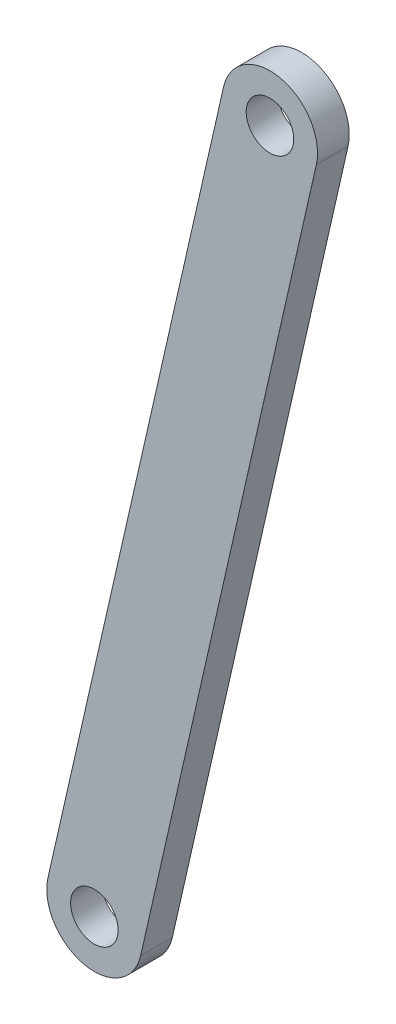
ISO-10303-21;
HEADER;
FILE_DESCRIPTION(('STEP AP214'),'2;1');
FILE_NAME('part.step','',(''),(''),'','','');
FILE_SCHEMA(('AUTOMOTIVE_DESIGN { 1 0 10303 214 1 1 1 1 }'));
ENDSEC;
DATA;
#1=APPLICATION_CONTEXT('core data for automotive mechanical design processes');
#2=APPLICATION_PROTOCOL_DEFINITION('international standard','automotive_design',2000,#1);
#3=PRODUCT_CONTEXT('',#1,'mechanical');
#4=PRODUCT('Part','Part','',(#3));
#5=PRODUCT_RELATED_PRODUCT_CATEGORY('part','',(#4));
#6=PRODUCT_DEFINITION_FORMATION('','',#4);
#7=PRODUCT_DEFINITION_CONTEXT('part definition',#1,'design');
#8=PRODUCT_DEFINITION('design','',#6,#7);
#9=PRODUCT_DEFINITION_SHAPE('','',#8);
#10=(LENGTH_UNIT() NAMED_UNIT(*) SI_UNIT(.MILLI.,.METRE.));
#11=(NAMED_UNIT(*) PLANE_ANGLE_UNIT() SI_UNIT($,.RADIAN.));
#12=(NAMED_UNIT(*) SI_UNIT($,.STERADIAN.) SOLID_ANGLE_UNIT());
#13=UNCERTAINTY_MEASURE_WITH_UNIT(LENGTH_MEASURE(1.E-05),#10,'distance_accuracy_value','');
#14=(GEOMETRIC_REPRESENTATION_CONTEXT(3) GLOBAL_UNCERTAINTY_ASSIGNED_CONTEXT((#13)) GLOBAL_UNIT_ASSIGNED_CONTEXT((#10,
#11,#12)) REPRESENTATION_CONTEXT('',''));
#15=CARTESIAN_POINT('',(0.,0.,0.));
#16=DIRECTION('',(0.,0.,1.));
#17=DIRECTION('',(1.,0.,0.));
#18=AXIS2_PLACEMENT_3D('',#15,#16,#17);
#19=CARTESIAN_POINT('',(0.,0.,10.));
#20=DIRECTION('',(0.,0.,1.));
#21=DIRECTION('',(1.,0.,0.));
#22=AXIS2_PLACEMENT_3D('',#19,#20,#21);
#23=PLANE('',#22);
#24=CARTESIAN_POINT('',(0.,0.,10.));
#25=DIRECTION('',(0.,0.,1.));
#26=DIRECTION('',(1.,0.,0.));
#27=AXIS2_PLACEMENT_3D('',#24,#25,#26);
#28=CIRCLE('',#27,7.5);
#29=CARTESIAN_POINT('',(7.5,0.,10.));
#30=VERTEX_POINT('',#29);
#31=EDGE_CURVE('E112',#30,#30,#28,.T.);
#32=ORIENTED_EDGE('',*,*,#31,.F.);
#33=EDGE_LOOP('',(#32));
#34=FACE_BOUND('',#33,.T.);
#35=CARTESIAN_POINT('',(0.,0.,10.));
#36=DIRECTION('',(0.,0.,1.));
#37=DIRECTION('',(1.,0.,0.));
#38=AXIS2_PLACEMENT_3D('',#35,#36,#37);
#39=CIRCLE('',#38,15.);
#40=CARTESIAN_POINT('',(-14.6269928368719,3.32431655383453,10.));
#41=VERTEX_POINT('',#40);
#42=CARTESIAN_POINT('',(14.6269928368719,-3.32431655383452,10.));
#43=VERTEX_POINT('',#42);
#44=EDGE_CURVE('E92',#41,#43,#39,.T.);
#45=ORIENTED_EDGE('',*,*,#44,.T.);
#46=DIRECTION('',(0.221621103588969,0.97513285579146,0.));
#47=VECTOR('',#46,1.);
#48=CARTESIAN_POINT('',(14.6269928368719,-3.32431655383452,10.));
#49=LINE('',#48,#47);
#50=CARTESIAN_POINT('',(70.032268734114,240.45889739403,10.));
#51=VERTEX_POINT('',#50);
#52=EDGE_CURVE('E87',#43,#51,#49,.T.);
#53=ORIENTED_EDGE('',*,*,#52,.T.);
#54=CARTESIAN_POINT('',(55.4052758972421,243.783213947865,10.));
#55=DIRECTION('',(0.,0.,1.));
#56=DIRECTION('',(1.,0.,0.));
#57=AXIS2_PLACEMENT_3D('',#54,#55,#56);
#58=CIRCLE('',#57,15.);
#59=CARTESIAN_POINT('',(40.7782830603702,247.107530501699,10.));
#60=VERTEX_POINT('',#59);
#61=EDGE_CURVE('E90',#51,#60,#58,.T.);
#62=ORIENTED_EDGE('',*,*,#61,.T.);
#63=DIRECTION('',(-0.221621103588968,-0.97513285579146,0.));
#64=VECTOR('',#63,1.);
#65=CARTESIAN_POINT('',(-14.6269928368719,3.32431655383453,10.));
#66=LINE('',#65,#64);
#67=EDGE_CURVE('E57',#60,#41,#66,.T.);
#68=ORIENTED_EDGE('',*,*,#67,.T.);
#69=EDGE_LOOP('',(#45,#53,#62,#68));
#70=FACE_BOUND('',#69,.T.);
#71=CARTESIAN_POINT('',(55.4052758972421,243.783213947865,10.));
#72=DIRECTION('',(0.,0.,1.));
#73=DIRECTION('',(1.,0.,0.));
#74=AXIS2_PLACEMENT_3D('',#71,#72,#73);
#75=CIRCLE('',#74,7.50000000000001);
#76=CARTESIAN_POINT('',(62.9052758972421,243.783213947865,10.));
#77=VERTEX_POINT('',#76);
#78=EDGE_CURVE('E134',#77,#77,#75,.T.);
#79=ORIENTED_EDGE('',*,*,#78,.F.);
#80=EDGE_LOOP('',(#79));
#81=FACE_BOUND('',#80,.T.);
#82=ADVANCED_FACE('F39',(#34,#70,#81),#23,.T.);
#83=CARTESIAN_POINT('',(0.,0.,0.));
#84=DIRECTION('',(0.,0.,1.));
#85=DIRECTION('',(1.,0.,0.));
#86=AXIS2_PLACEMENT_3D('',#83,#84,#85);
#87=PLANE('',#86);
#88=CARTESIAN_POINT('',(0.,0.,0.));
#89=DIRECTION('',(0.,0.,1.));
#90=DIRECTION('',(1.,0.,0.));
#91=AXIS2_PLACEMENT_3D('',#88,#89,#90);
#92=CIRCLE('',#91,15.);
#93=CARTESIAN_POINT('',(-14.6269928368719,3.32431655383453,0.));
#94=VERTEX_POINT('',#93);
#95=CARTESIAN_POINT('',(14.6269928368719,-3.32431655383452,0.));
#96=VERTEX_POINT('',#95);
#97=EDGE_CURVE('E108',#94,#96,#92,.T.);
#98=ORIENTED_EDGE('',*,*,#97,.F.);
#99=DIRECTION('',(-0.221621103588968,-0.97513285579146,0.));
#100=VECTOR('',#99,1.);
#101=CARTESIAN_POINT('',(-14.6269928368719,3.32431655383453,0.));
#102=LINE('',#101,#100);
#103=CARTESIAN_POINT('',(40.7782830603702,247.107530501699,0.));
#104=VERTEX_POINT('',#103);
#105=EDGE_CURVE('E80',#104,#94,#102,.T.);
#106=ORIENTED_EDGE('',*,*,#105,.F.);
#107=CARTESIAN_POINT('',(55.4052758972421,243.783213947865,0.));
#108=DIRECTION('',(0.,0.,1.));
#109=DIRECTION('',(1.,0.,0.));
#110=AXIS2_PLACEMENT_3D('',#107,#108,#109);
#111=CIRCLE('',#110,15.);
#112=CARTESIAN_POINT('',(70.032268734114,240.45889739403,0.));
#113=VERTEX_POINT('',#112);
#114=EDGE_CURVE('E74',#113,#104,#111,.T.);
#115=ORIENTED_EDGE('',*,*,#114,.F.);
#116=DIRECTION('',(0.221621103588969,0.97513285579146,0.));
#117=VECTOR('',#116,1.);
#118=CARTESIAN_POINT('',(14.6269928368719,-3.32431655383452,0.));
#119=LINE('',#118,#117);
#120=EDGE_CURVE('E97',#96,#113,#119,.T.);
#121=ORIENTED_EDGE('',*,*,#120,.F.);
#122=EDGE_LOOP('',(#98,#106,#115,#121));
#123=FACE_BOUND('',#122,.T.);
#124=CARTESIAN_POINT('',(0.,0.,0.));
#125=DIRECTION('',(0.,0.,1.));
#126=DIRECTION('',(1.,0.,0.));
#127=AXIS2_PLACEMENT_3D('',#124,#125,#126);
#128=CIRCLE('',#127,7.5);
#129=CARTESIAN_POINT('',(7.5,0.,0.));
#130=VERTEX_POINT('',#129);
#131=EDGE_CURVE('E130',#130,#130,#128,.T.);
#132=ORIENTED_EDGE('',*,*,#131,.T.);
#133=EDGE_LOOP('',(#132));
#134=FACE_BOUND('',#133,.T.);
#135=CARTESIAN_POINT('',(55.4052758972421,243.783213947865,0.));
#136=DIRECTION('',(0.,0.,1.));
#137=DIRECTION('',(1.,0.,0.));
#138=AXIS2_PLACEMENT_3D('',#135,#136,#137);
#139=CIRCLE('',#138,7.50000000000001);
#140=CARTESIAN_POINT('',(62.9052758972421,243.783213947865,0.));
#141=VERTEX_POINT('',#140);
#142=EDGE_CURVE('E138',#141,#141,#139,.T.);
#143=ORIENTED_EDGE('',*,*,#142,.T.);
#144=EDGE_LOOP('',(#143));
#145=FACE_BOUND('',#144,.T.);
#146=ADVANCED_FACE('F125',(#123,#134,#145),#87,.F.);
#147=CARTESIAN_POINT('',(0.,0.,10.));
#148=DIRECTION('',(0.,0.,-1.));
#149=DIRECTION('',(-1.,0.,0.));
#150=AXIS2_PLACEMENT_3D('',#147,#148,#149);
#151=CYLINDRICAL_SURFACE('',#150,15.);
#152=ORIENTED_EDGE('',*,*,#97,.T.);
#153=DIRECTION('',(0.,0.,-1.));
#154=VECTOR('',#153,1.);
#155=CARTESIAN_POINT('',(14.6269928368719,-3.32431655383452,10.));
#156=LINE('',#155,#154);
#157=EDGE_CURVE('E11',#43,#96,#156,.T.);
#158=ORIENTED_EDGE('',*,*,#157,.F.);
#159=ORIENTED_EDGE('',*,*,#44,.F.);
#160=DIRECTION('',(0.,0.,-1.));
#161=VECTOR('',#160,1.);
#162=CARTESIAN_POINT('',(-14.6269928368719,3.32431655383453,10.));
#163=LINE('',#162,#161);
#164=EDGE_CURVE('E104',#41,#94,#163,.T.);
#165=ORIENTED_EDGE('',*,*,#164,.T.);
#166=EDGE_LOOP('',(#152,#158,#159,#165));
#167=FACE_BOUND('',#166,.T.);
#168=ADVANCED_FACE('F41',(#167),#151,.T.);
#169=CARTESIAN_POINT('',(14.6269928368719,-3.32431655383452,10.));
#170=DIRECTION('',(-0.97513285579146,0.221621103588968,0.));
#171=DIRECTION('',(-0.221621103588968,-0.97513285579146,0.));
#172=AXIS2_PLACEMENT_3D('',#169,#170,#171);
#173=PLANE('',#172);
#174=ORIENTED_EDGE('',*,*,#120,.T.);
#175=DIRECTION('',(0.,0.,-1.));
#176=VECTOR('',#175,1.);
#177=CARTESIAN_POINT('',(70.032268734114,240.45889739403,10.));
#178=LINE('',#177,#176);
#179=EDGE_CURVE('E49',#51,#113,#178,.T.);
#180=ORIENTED_EDGE('',*,*,#179,.F.);
#181=ORIENTED_EDGE('',*,*,#52,.F.);
#182=ORIENTED_EDGE('',*,*,#157,.T.);
#183=EDGE_LOOP('',(#174,#180,#181,#182));
#184=FACE_BOUND('',#183,.T.);
#185=ADVANCED_FACE('F96',(#184),#173,.F.);
#186=CARTESIAN_POINT('',(55.4052758972421,243.783213947865,10.));
#187=DIRECTION('',(0.,0.,-1.));
#188=DIRECTION('',(-1.,0.,0.));
#189=AXIS2_PLACEMENT_3D('',#186,#187,#188);
#190=CYLINDRICAL_SURFACE('',#189,15.);
#191=ORIENTED_EDGE('',*,*,#114,.T.);
#192=DIRECTION('',(0.,0.,-1.));
#193=VECTOR('',#192,1.);
#194=CARTESIAN_POINT('',(40.7782830603702,247.107530501699,10.));
#195=LINE('',#194,#193);
#196=EDGE_CURVE('E99',#60,#104,#195,.T.);
#197=ORIENTED_EDGE('',*,*,#196,.F.);
#198=ORIENTED_EDGE('',*,*,#61,.F.);
#199=ORIENTED_EDGE('',*,*,#179,.T.);
#200=EDGE_LOOP('',(#191,#197,#198,#199));
#201=FACE_BOUND('',#200,.T.);
#202=ADVANCED_FACE('F100',(#201),#190,.T.);
#203=CARTESIAN_POINT('',(-14.6269928368719,3.32431655383453,10.));
#204=DIRECTION('',(0.97513285579146,-0.221621103588968,0.));
#205=DIRECTION('',(0.221621103588968,0.97513285579146,0.));
#206=AXIS2_PLACEMENT_3D('',#203,#204,#205);
#207=PLANE('',#206);
#208=ORIENTED_EDGE('',*,*,#105,.T.);
#209=ORIENTED_EDGE('',*,*,#164,.F.);
#210=ORIENTED_EDGE('',*,*,#67,.F.);
#211=ORIENTED_EDGE('',*,*,#196,.T.);
#212=EDGE_LOOP('',(#208,#209,#210,#211));
#213=FACE_BOUND('',#212,.T.);
#214=ADVANCED_FACE('F122',(#213),#207,.F.);
#215=CARTESIAN_POINT('',(0.,0.,10.));
#216=DIRECTION('',(0.,0.,-1.));
#217=DIRECTION('',(-1.,0.,0.));
#218=AXIS2_PLACEMENT_3D('',#215,#216,#217);
#219=CYLINDRICAL_SURFACE('',#218,7.5);
#220=ORIENTED_EDGE('',*,*,#31,.T.);
#221=EDGE_LOOP('',(#220));
#222=FACE_BOUND('',#221,.T.);
#223=ORIENTED_EDGE('',*,*,#131,.F.);
#224=EDGE_LOOP('',(#223));
#225=FACE_BOUND('',#224,.T.);
#226=ADVANCED_FACE('F157',(#222,#225),#219,.F.);
#227=CARTESIAN_POINT('',(55.4052758972421,243.783213947865,10.));
#228=DIRECTION('',(0.,0.,-1.));
#229=DIRECTION('',(-1.,0.,0.));
#230=AXIS2_PLACEMENT_3D('',#227,#228,#229);
#231=CYLINDRICAL_SURFACE('',#230,7.50000000000001);
#232=ORIENTED_EDGE('',*,*,#78,.T.);
#233=EDGE_LOOP('',(#232));
#234=FACE_BOUND('',#233,.T.);
#235=ORIENTED_EDGE('',*,*,#142,.F.);
#236=EDGE_LOOP('',(#235));
#237=FACE_BOUND('',#236,.T.);
#238=ADVANCED_FACE('F146',(#234,#237),#231,.F.);
#239=CLOSED_SHELL('',(#82,#146,#168,#185,#202,#214,#226,#238));
#240=MANIFOLD_SOLID_BREP('B2',#239);
#241=ADVANCED_BREP_SHAPE_REPRESENTATION('',(#18,#240),#14);
#242=SHAPE_DEFINITION_REPRESENTATION(#9,#241);
ENDSEC;
END-ISO-10303-21;
